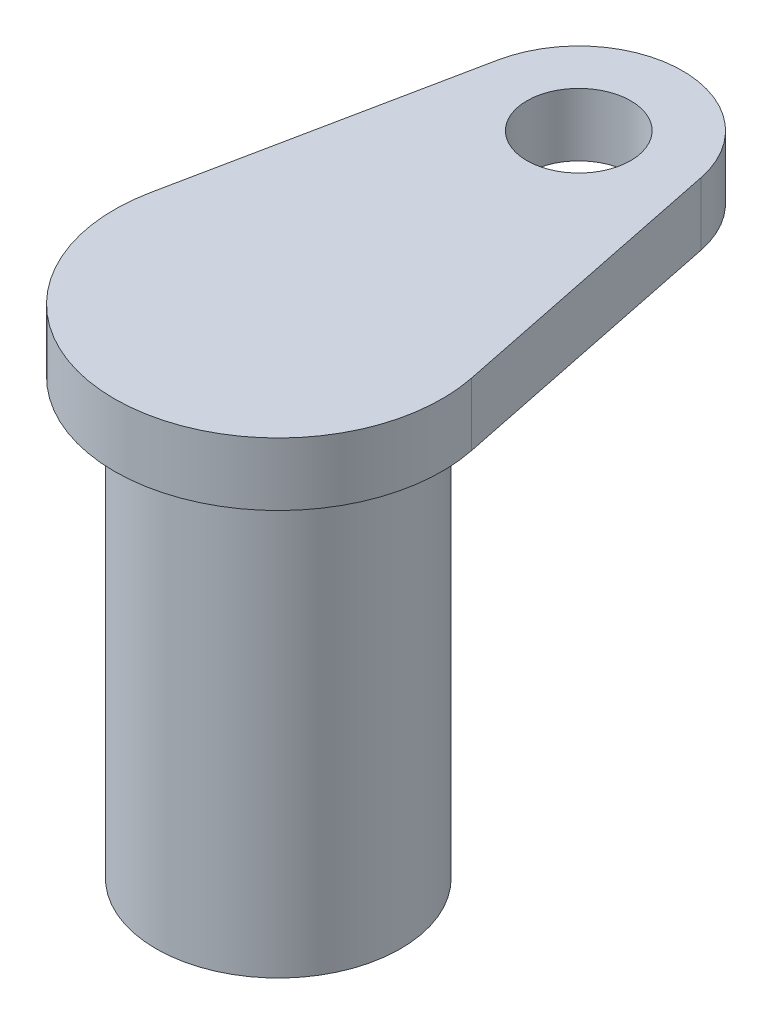
ISO-10303-21;
HEADER;
FILE_DESCRIPTION(('STEP AP214'),'2;1');
FILE_NAME('part.step','',(''),(''),'','','');
FILE_SCHEMA(('AUTOMOTIVE_DESIGN { 1 0 10303 214 1 1 1 1 }'));
ENDSEC;
DATA;
#1=APPLICATION_CONTEXT('core data for automotive mechanical design processes');
#2=APPLICATION_PROTOCOL_DEFINITION('international standard','automotive_design',2000,#1);
#3=PRODUCT_CONTEXT('',#1,'mechanical');
#4=PRODUCT('Part','Part','',(#3));
#5=PRODUCT_RELATED_PRODUCT_CATEGORY('part','',(#4));
#6=PRODUCT_DEFINITION_FORMATION('','',#4);
#7=PRODUCT_DEFINITION_CONTEXT('part definition',#1,'design');
#8=PRODUCT_DEFINITION('design','',#6,#7);
#9=PRODUCT_DEFINITION_SHAPE('','',#8);
#10=(LENGTH_UNIT() NAMED_UNIT(*) SI_UNIT(.MILLI.,.METRE.));
#11=(NAMED_UNIT(*) PLANE_ANGLE_UNIT() SI_UNIT($,.RADIAN.));
#12=(NAMED_UNIT(*) SI_UNIT($,.STERADIAN.) SOLID_ANGLE_UNIT());
#13=UNCERTAINTY_MEASURE_WITH_UNIT(LENGTH_MEASURE(1.E-05),#10,'distance_accuracy_value','');
#14=(GEOMETRIC_REPRESENTATION_CONTEXT(3) GLOBAL_UNCERTAINTY_ASSIGNED_CONTEXT((#13)) GLOBAL_UNIT_ASSIGNED_CONTEXT((#10,
#11,#12)) REPRESENTATION_CONTEXT('',''));
#15=CARTESIAN_POINT('',(0.,0.,0.));
#16=DIRECTION('',(0.,0.,1.));
#17=DIRECTION('',(1.,0.,0.));
#18=AXIS2_PLACEMENT_3D('',#15,#16,#17);
#19=CARTESIAN_POINT('',(11.7575507653592,4.6,-2.4));
#20=DIRECTION('',(-0.979795897113271,0.,0.2));
#21=DIRECTION('',(0.2,0.,0.979795897113271));
#22=AXIS2_PLACEMENT_3D('',#19,#20,#21);
#23=PLANE('',#22);
#24=DIRECTION('',(-0.2,0.,-0.979795897113271));
#25=VECTOR('',#24,1.);
#26=CARTESIAN_POINT('',(11.7575507653592,0.,-2.4));
#27=LINE('',#26,#25);
#28=CARTESIAN_POINT('',(11.7575507653592,0.,-2.4));
#29=VERTEX_POINT('',#28);
#30=CARTESIAN_POINT('',(7.44644881806086,0.,-23.52));
#31=VERTEX_POINT('',#30);
#32=EDGE_CURVE('E98',#29,#31,#27,.T.);
#33=ORIENTED_EDGE('',*,*,#32,.T.);
#34=DIRECTION('',(0.,-1.,0.));
#35=VECTOR('',#34,1.);
#36=CARTESIAN_POINT('',(7.44644881806086,4.6,-23.52));
#37=LINE('',#36,#35);
#38=CARTESIAN_POINT('',(7.44644881806086,4.6,-23.52));
#39=VERTEX_POINT('',#38);
#40=EDGE_CURVE('E11',#39,#31,#37,.T.);
#41=ORIENTED_EDGE('',*,*,#40,.F.);
#42=DIRECTION('',(-0.2,0.,-0.979795897113271));
#43=VECTOR('',#42,1.);
#44=CARTESIAN_POINT('',(11.7575507653592,4.6,-2.4));
#45=LINE('',#44,#43);
#46=CARTESIAN_POINT('',(11.7575507653592,4.6,-2.4));
#47=VERTEX_POINT('',#46);
#48=EDGE_CURVE('E83',#47,#39,#45,.T.);
#49=ORIENTED_EDGE('',*,*,#48,.F.);
#50=DIRECTION('',(0.,-1.,0.));
#51=VECTOR('',#50,1.);
#52=CARTESIAN_POINT('',(11.7575507653592,4.6,-2.4));
#53=LINE('',#52,#51);
#54=EDGE_CURVE('E94',#47,#29,#53,.T.);
#55=ORIENTED_EDGE('',*,*,#54,.T.);
#56=EDGE_LOOP('',(#33,#41,#49,#55));
#57=FACE_BOUND('',#56,.T.);
#58=ADVANCED_FACE('F36',(#57),#23,.F.);
#59=CARTESIAN_POINT('',(0.,4.6,-22.));
#60=DIRECTION('',(0.,-1.,0.));
#61=DIRECTION('',(0.,0.,-1.));
#62=AXIS2_PLACEMENT_3D('',#59,#60,#61);
#63=CYLINDRICAL_SURFACE('',#62,7.6);
#64=CARTESIAN_POINT('',(0.,0.,-22.));
#65=DIRECTION('',(0.,1.,0.));
#66=DIRECTION('',(0.,0.,1.));
#67=AXIS2_PLACEMENT_3D('',#64,#65,#66);
#68=CIRCLE('',#67,7.6);
#69=CARTESIAN_POINT('',(-7.44644881806086,0.,-23.52));
#70=VERTEX_POINT('',#69);
#71=EDGE_CURVE('E88',#31,#70,#68,.T.);
#72=ORIENTED_EDGE('',*,*,#71,.T.);
#73=DIRECTION('',(0.,-1.,0.));
#74=VECTOR('',#73,1.);
#75=CARTESIAN_POINT('',(-7.44644881806086,4.6,-23.52));
#76=LINE('',#75,#74);
#77=CARTESIAN_POINT('',(-7.44644881806086,4.6,-23.52));
#78=VERTEX_POINT('',#77);
#79=EDGE_CURVE('E44',#78,#70,#76,.T.);
#80=ORIENTED_EDGE('',*,*,#79,.F.);
#81=CARTESIAN_POINT('',(0.,4.6,-22.));
#82=DIRECTION('',(0.,1.,0.));
#83=DIRECTION('',(0.,0.,1.));
#84=AXIS2_PLACEMENT_3D('',#81,#82,#83);
#85=CIRCLE('',#84,7.6);
#86=EDGE_CURVE('E78',#39,#78,#85,.T.);
#87=ORIENTED_EDGE('',*,*,#86,.F.);
#88=ORIENTED_EDGE('',*,*,#40,.T.);
#89=EDGE_LOOP('',(#72,#80,#87,#88));
#90=FACE_BOUND('',#89,.T.);
#91=ADVANCED_FACE('F87',(#90),#63,.T.);
#92=CARTESIAN_POINT('',(-11.7575507653592,4.6,-2.4));
#93=DIRECTION('',(-0.979795897113271,0.,-0.2));
#94=DIRECTION('',(-0.2,0.,0.979795897113271));
#95=AXIS2_PLACEMENT_3D('',#92,#93,#94);
#96=PLANE('',#95);
#97=DIRECTION('',(0.2,0.,-0.979795897113271));
#98=VECTOR('',#97,1.);
#99=CARTESIAN_POINT('',(-11.7575507653592,0.,-2.4));
#100=LINE('',#99,#98);
#101=CARTESIAN_POINT('',(-11.7575507653592,0.,-2.4));
#102=VERTEX_POINT('',#101);
#103=EDGE_CURVE('E103',#102,#70,#100,.T.);
#104=ORIENTED_EDGE('',*,*,#103,.F.);
#105=DIRECTION('',(0.,-1.,0.));
#106=VECTOR('',#105,1.);
#107=CARTESIAN_POINT('',(-11.7575507653592,4.6,-2.4));
#108=LINE('',#107,#106);
#109=CARTESIAN_POINT('',(-11.7575507653592,4.6,-2.4));
#110=VERTEX_POINT('',#109);
#111=EDGE_CURVE('E68',#110,#102,#108,.T.);
#112=ORIENTED_EDGE('',*,*,#111,.F.);
#113=DIRECTION('',(0.2,0.,-0.979795897113271));
#114=VECTOR('',#113,1.);
#115=CARTESIAN_POINT('',(-11.7575507653592,4.6,-2.4));
#116=LINE('',#115,#114);
#117=EDGE_CURVE('E81',#110,#78,#116,.T.);
#118=ORIENTED_EDGE('',*,*,#117,.T.);
#119=ORIENTED_EDGE('',*,*,#79,.T.);
#120=EDGE_LOOP('',(#104,#112,#118,#119));
#121=FACE_BOUND('',#120,.T.);
#122=ADVANCED_FACE('F92',(#121),#96,.T.);
#123=CARTESIAN_POINT('',(0.,4.6,0.));
#124=DIRECTION('',(0.,-1.,0.));
#125=DIRECTION('',(0.,0.,-1.));
#126=AXIS2_PLACEMENT_3D('',#123,#124,#125);
#127=CYLINDRICAL_SURFACE('',#126,12.);
#128=CARTESIAN_POINT('',(0.,0.,0.));
#129=DIRECTION('',(0.,1.,0.));
#130=DIRECTION('',(0.,0.,1.));
#131=AXIS2_PLACEMENT_3D('',#128,#129,#130);
#132=CIRCLE('',#131,12.);
#133=EDGE_CURVE('E71',#102,#29,#132,.T.);
#134=ORIENTED_EDGE('',*,*,#133,.T.);
#135=ORIENTED_EDGE('',*,*,#54,.F.);
#136=CARTESIAN_POINT('',(0.,4.6,0.));
#137=DIRECTION('',(0.,1.,0.));
#138=DIRECTION('',(0.,0.,1.));
#139=AXIS2_PLACEMENT_3D('',#136,#137,#138);
#140=CIRCLE('',#139,12.);
#141=EDGE_CURVE('E52',#110,#47,#140,.T.);
#142=ORIENTED_EDGE('',*,*,#141,.F.);
#143=ORIENTED_EDGE('',*,*,#111,.T.);
#144=EDGE_LOOP('',(#134,#135,#142,#143));
#145=FACE_BOUND('',#144,.T.);
#146=ADVANCED_FACE('F122',(#145),#127,.T.);
#147=CARTESIAN_POINT('',(0.,4.6,0.));
#148=DIRECTION('',(0.,1.,0.));
#149=DIRECTION('',(0.,0.,1.));
#150=AXIS2_PLACEMENT_3D('',#147,#148,#149);
#151=PLANE('',#150);
#152=CARTESIAN_POINT('',(0.,4.6,-22.));
#153=DIRECTION('',(0.,1.,0.));
#154=DIRECTION('',(0.,0.,1.));
#155=AXIS2_PLACEMENT_3D('',#152,#153,#154);
#156=CIRCLE('',#155,3.79999999999999);
#157=CARTESIAN_POINT('',(0.,4.6,-18.2));
#158=VERTEX_POINT('',#157);
#159=EDGE_CURVE('E183',#158,#158,#156,.F.);
#160=ORIENTED_EDGE('',*,*,#159,.T.);
#161=EDGE_LOOP('',(#160));
#162=FACE_BOUND('',#161,.T.);
#163=ORIENTED_EDGE('',*,*,#48,.T.);
#164=ORIENTED_EDGE('',*,*,#86,.T.);
#165=ORIENTED_EDGE('',*,*,#117,.F.);
#166=ORIENTED_EDGE('',*,*,#141,.T.);
#167=EDGE_LOOP('',(#163,#164,#165,#166));
#168=FACE_BOUND('',#167,.T.);
#169=ADVANCED_FACE('F79',(#162,#168),#151,.T.);
#170=CARTESIAN_POINT('',(0.,0.,0.));
#171=DIRECTION('',(0.,1.,0.));
#172=DIRECTION('',(0.,0.,1.));
#173=AXIS2_PLACEMENT_3D('',#170,#171,#172);
#174=PLANE('',#173);
#175=CARTESIAN_POINT('',(0.,0.,-22.));
#176=DIRECTION('',(0.,-1.,0.));
#177=DIRECTION('',(0.,0.,-1.));
#178=AXIS2_PLACEMENT_3D('',#175,#176,#177);
#179=CIRCLE('',#178,3.79999999999999);
#180=CARTESIAN_POINT('',(0.,0.,-25.8));
#181=VERTEX_POINT('',#180);
#182=EDGE_CURVE('E188',#181,#181,#179,.T.);
#183=ORIENTED_EDGE('',*,*,#182,.F.);
#184=EDGE_LOOP('',(#183));
#185=FACE_BOUND('',#184,.T.);
#186=CARTESIAN_POINT('',(0.,0.,0.));
#187=DIRECTION('',(0.,1.,0.));
#188=DIRECTION('',(0.,0.,1.));
#189=AXIS2_PLACEMENT_3D('',#186,#187,#188);
#190=CIRCLE('',#189,8.95);
#191=CARTESIAN_POINT('',(0.,0.,8.95));
#192=VERTEX_POINT('',#191);
#193=EDGE_CURVE('E180',#192,#192,#190,.T.);
#194=ORIENTED_EDGE('',*,*,#193,.T.);
#195=EDGE_LOOP('',(#194));
#196=FACE_BOUND('',#195,.T.);
#197=ORIENTED_EDGE('',*,*,#32,.F.);
#198=ORIENTED_EDGE('',*,*,#133,.F.);
#199=ORIENTED_EDGE('',*,*,#103,.T.);
#200=ORIENTED_EDGE('',*,*,#71,.F.);
#201=EDGE_LOOP('',(#197,#198,#199,#200));
#202=FACE_BOUND('',#201,.T.);
#203=ADVANCED_FACE('F110',(#185,#196,#202),#174,.F.);
#204=CARTESIAN_POINT('',(0.,-31.8,0.));
#205=DIRECTION('',(0.,1.,0.));
#206=DIRECTION('',(0.,0.,1.));
#207=AXIS2_PLACEMENT_3D('',#204,#205,#206);
#208=CYLINDRICAL_SURFACE('',#207,8.95);
#209=CARTESIAN_POINT('',(0.,-31.8,0.));
#210=DIRECTION('',(0.,1.,0.));
#211=DIRECTION('',(0.,0.,1.));
#212=AXIS2_PLACEMENT_3D('',#209,#210,#211);
#213=CIRCLE('',#212,8.95);
#214=CARTESIAN_POINT('',(0.,-31.8,8.95));
#215=VERTEX_POINT('',#214);
#216=EDGE_CURVE('E101',#215,#215,#213,.T.);
#217=ORIENTED_EDGE('',*,*,#216,.T.);
#218=EDGE_LOOP('',(#217));
#219=FACE_BOUND('',#218,.T.);
#220=ORIENTED_EDGE('',*,*,#193,.F.);
#221=EDGE_LOOP('',(#220));
#222=FACE_BOUND('',#221,.T.);
#223=ADVANCED_FACE('F112',(#219,#222),#208,.T.);
#224=CARTESIAN_POINT('',(0.,-31.8,0.));
#225=DIRECTION('',(0.,1.,0.));
#226=DIRECTION('',(0.,0.,1.));
#227=AXIS2_PLACEMENT_3D('',#224,#225,#226);
#228=PLANE('',#227);
#229=ORIENTED_EDGE('',*,*,#216,.F.);
#230=EDGE_LOOP('',(#229));
#231=FACE_BOUND('',#230,.T.);
#232=ADVANCED_FACE('F119',(#231),#228,.F.);
#233=CARTESIAN_POINT('',(0.,0.,-22.));
#234=DIRECTION('',(0.,-1.,0.));
#235=DIRECTION('',(0.,0.,-1.));
#236=AXIS2_PLACEMENT_3D('',#233,#234,#235);
#237=CYLINDRICAL_SURFACE('',#236,3.79999999999999);
#238=ORIENTED_EDGE('',*,*,#159,.F.);
#239=EDGE_LOOP('',(#238));
#240=FACE_BOUND('',#239,.T.);
#241=ORIENTED_EDGE('',*,*,#182,.T.);
#242=EDGE_LOOP('',(#241));
#243=FACE_BOUND('',#242,.T.);
#244=ADVANCED_FACE('F160',(#240,#243),#237,.F.);
#245=CLOSED_SHELL('',(#58,#91,#122,#146,#169,#203,#223,#232,#244));
#246=MANIFOLD_SOLID_BREP('B2',#245);
#247=ADVANCED_BREP_SHAPE_REPRESENTATION('',(#18,#246),#14);
#248=SHAPE_DEFINITION_REPRESENTATION(#9,#247);
ENDSEC;
END-ISO-10303-21;
